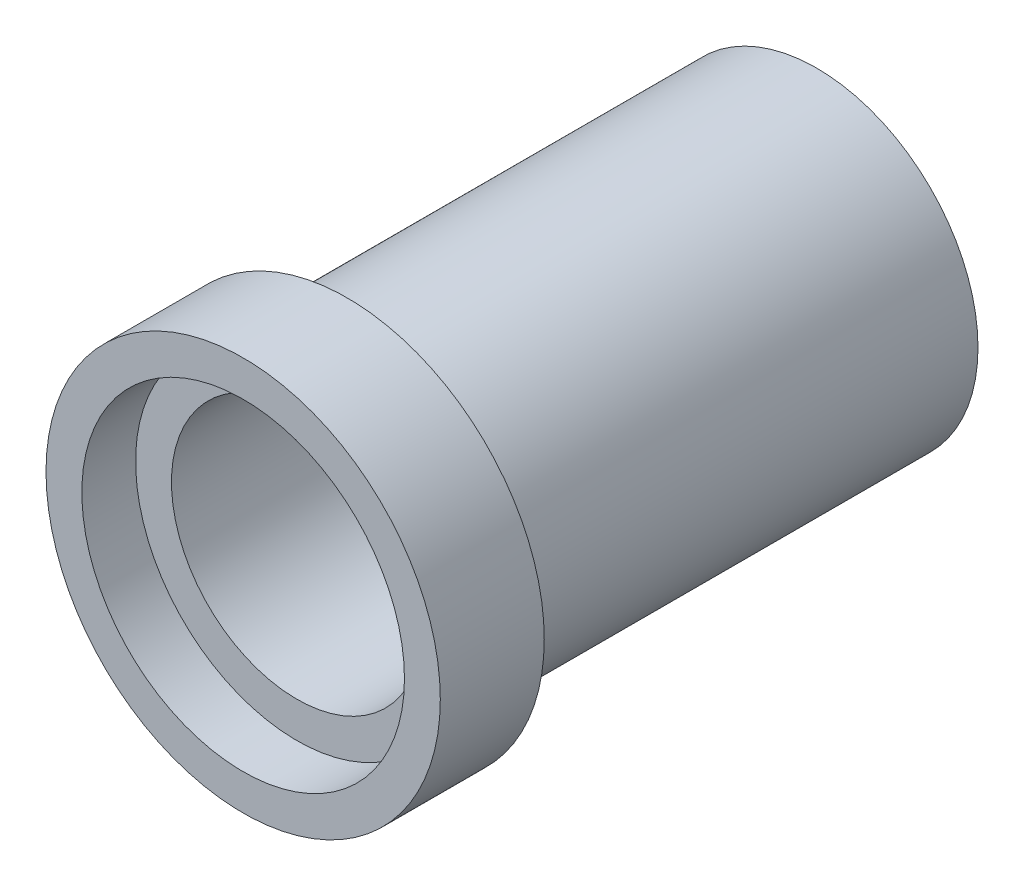
ISO-10303-21;
HEADER;
FILE_DESCRIPTION(('STEP AP214'),'2;1');
FILE_NAME('part.step','',(''),(''),'','','');
FILE_SCHEMA(('AUTOMOTIVE_DESIGN { 1 0 10303 214 1 1 1 1 }'));
ENDSEC;
DATA;
#1=APPLICATION_CONTEXT('core data for automotive mechanical design processes');
#2=APPLICATION_PROTOCOL_DEFINITION('international standard','automotive_design',2000,#1);
#3=PRODUCT_CONTEXT('',#1,'mechanical');
#4=PRODUCT('Part','Part','',(#3));
#5=PRODUCT_RELATED_PRODUCT_CATEGORY('part','',(#4));
#6=PRODUCT_DEFINITION_FORMATION('','',#4);
#7=PRODUCT_DEFINITION_CONTEXT('part definition',#1,'design');
#8=PRODUCT_DEFINITION('design','',#6,#7);
#9=PRODUCT_DEFINITION_SHAPE('','',#8);
#10=(LENGTH_UNIT() NAMED_UNIT(*) SI_UNIT(.MILLI.,.METRE.));
#11=(NAMED_UNIT(*) PLANE_ANGLE_UNIT() SI_UNIT($,.RADIAN.));
#12=(NAMED_UNIT(*) SI_UNIT($,.STERADIAN.) SOLID_ANGLE_UNIT());
#13=UNCERTAINTY_MEASURE_WITH_UNIT(LENGTH_MEASURE(1.E-05),#10,'distance_accuracy_value','');
#14=(GEOMETRIC_REPRESENTATION_CONTEXT(3) GLOBAL_UNCERTAINTY_ASSIGNED_CONTEXT((#13)) GLOBAL_UNIT_ASSIGNED_CONTEXT((#10,
#11,#12)) REPRESENTATION_CONTEXT('',''));
#15=CARTESIAN_POINT('',(0.,0.,0.));
#16=DIRECTION('',(0.,0.,1.));
#17=DIRECTION('',(1.,0.,0.));
#18=AXIS2_PLACEMENT_3D('',#15,#16,#17);
#19=CARTESIAN_POINT('',(0.,9.,16.));
#20=DIRECTION('',(0.,0.,-1.));
#21=DIRECTION('',(-1.,0.,0.));
#22=AXIS2_PLACEMENT_3D('',#19,#20,#21);
#23=PLANE('',#22);
#24=CARTESIAN_POINT('',(0.,0.,16.));
#25=DIRECTION('',(0.,0.,1.));
#26=DIRECTION('',(1.,0.,0.));
#27=AXIS2_PLACEMENT_3D('',#24,#25,#26);
#28=CIRCLE('',#27,9.);
#29=CARTESIAN_POINT('',(9.,0.,16.));
#30=VERTEX_POINT('',#29);
#31=EDGE_CURVE('E53',#30,#30,#28,.T.);
#32=ORIENTED_EDGE('',*,*,#31,.F.);
#33=EDGE_LOOP('',(#32));
#34=FACE_BOUND('',#33,.T.);
#35=CARTESIAN_POINT('',(0.,0.,16.));
#36=DIRECTION('',(0.,0.,1.));
#37=DIRECTION('',(1.,0.,0.));
#38=AXIS2_PLACEMENT_3D('',#35,#36,#37);
#39=CIRCLE('',#38,11.);
#40=CARTESIAN_POINT('',(11.,0.,16.));
#41=VERTEX_POINT('',#40);
#42=EDGE_CURVE('E10',#41,#41,#39,.T.);
#43=ORIENTED_EDGE('',*,*,#42,.T.);
#44=EDGE_LOOP('',(#43));
#45=FACE_BOUND('',#44,.T.);
#46=ADVANCED_FACE('F31',(#34,#45),#23,.F.);
#47=CARTESIAN_POINT('',(0.,0.,152.237580051673));
#48=DIRECTION('',(0.,0.,1.));
#49=DIRECTION('',(1.,0.,0.));
#50=AXIS2_PLACEMENT_3D('',#47,#48,#49);
#51=CYLINDRICAL_SURFACE('',#50,11.);
#52=ORIENTED_EDGE('',*,*,#42,.F.);
#53=EDGE_LOOP('',(#52));
#54=FACE_BOUND('',#53,.T.);
#55=CARTESIAN_POINT('',(0.,0.,10.2));
#56=DIRECTION('',(0.,0.,1.));
#57=DIRECTION('',(1.,0.,0.));
#58=AXIS2_PLACEMENT_3D('',#55,#56,#57);
#59=CIRCLE('',#58,11.);
#60=CARTESIAN_POINT('',(11.,0.,10.2));
#61=VERTEX_POINT('',#60);
#62=EDGE_CURVE('E37',#61,#61,#59,.T.);
#63=ORIENTED_EDGE('',*,*,#62,.T.);
#64=EDGE_LOOP('',(#63));
#65=FACE_BOUND('',#64,.T.);
#66=ADVANCED_FACE('F76',(#54,#65),#51,.T.);
#67=CARTESIAN_POINT('',(0.,11.,10.2));
#68=DIRECTION('',(0.,0.,1.));
#69=DIRECTION('',(1.,0.,0.));
#70=AXIS2_PLACEMENT_3D('',#67,#68,#69);
#71=PLANE('',#70);
#72=ORIENTED_EDGE('',*,*,#62,.F.);
#73=EDGE_LOOP('',(#72));
#74=FACE_BOUND('',#73,.T.);
#75=CARTESIAN_POINT('',(0.,0.,10.2));
#76=DIRECTION('',(0.,0.,1.));
#77=DIRECTION('',(1.,0.,0.));
#78=AXIS2_PLACEMENT_3D('',#75,#76,#77);
#79=CIRCLE('',#78,9.);
#80=CARTESIAN_POINT('',(9.,0.,10.2));
#81=VERTEX_POINT('',#80);
#82=EDGE_CURVE('E41',#81,#81,#79,.T.);
#83=ORIENTED_EDGE('',*,*,#82,.T.);
#84=EDGE_LOOP('',(#83));
#85=FACE_BOUND('',#84,.T.);
#86=ADVANCED_FACE('F81',(#74,#85),#71,.F.);
#87=CARTESIAN_POINT('',(0.,0.,152.237580051673));
#88=DIRECTION('',(0.,0.,1.));
#89=DIRECTION('',(1.,0.,0.));
#90=AXIS2_PLACEMENT_3D('',#87,#88,#89);
#91=CYLINDRICAL_SURFACE('',#90,9.);
#92=ORIENTED_EDGE('',*,*,#82,.F.);
#93=EDGE_LOOP('',(#92));
#94=FACE_BOUND('',#93,.T.);
#95=CARTESIAN_POINT('',(0.,0.,-16.));
#96=DIRECTION('',(0.,0.,1.));
#97=DIRECTION('',(1.,0.,0.));
#98=AXIS2_PLACEMENT_3D('',#95,#96,#97);
#99=CIRCLE('',#98,9.);
#100=CARTESIAN_POINT('',(9.,0.,-16.));
#101=VERTEX_POINT('',#100);
#102=EDGE_CURVE('E45',#101,#101,#99,.T.);
#103=ORIENTED_EDGE('',*,*,#102,.T.);
#104=EDGE_LOOP('',(#103));
#105=FACE_BOUND('',#104,.T.);
#106=ADVANCED_FACE('F88',(#94,#105),#91,.T.);
#107=CARTESIAN_POINT('',(0.,7.,-16.));
#108=DIRECTION('',(0.,0.,1.));
#109=DIRECTION('',(1.,0.,0.));
#110=AXIS2_PLACEMENT_3D('',#107,#108,#109);
#111=PLANE('',#110);
#112=ORIENTED_EDGE('',*,*,#102,.F.);
#113=EDGE_LOOP('',(#112));
#114=FACE_BOUND('',#113,.T.);
#115=CARTESIAN_POINT('',(0.,0.,-16.));
#116=DIRECTION('',(0.,0.,1.));
#117=DIRECTION('',(1.,0.,0.));
#118=AXIS2_PLACEMENT_3D('',#115,#116,#117);
#119=CIRCLE('',#118,7.);
#120=CARTESIAN_POINT('',(7.,0.,-16.));
#121=VERTEX_POINT('',#120);
#122=EDGE_CURVE('E50',#121,#121,#119,.T.);
#123=ORIENTED_EDGE('',*,*,#122,.T.);
#124=EDGE_LOOP('',(#123));
#125=FACE_BOUND('',#124,.T.);
#126=ADVANCED_FACE('F94',(#114,#125),#111,.F.);
#127=CARTESIAN_POINT('',(0.,0.,152.237580051673));
#128=DIRECTION('',(0.,0.,1.));
#129=DIRECTION('',(1.,0.,0.));
#130=AXIS2_PLACEMENT_3D('',#127,#128,#129);
#131=CYLINDRICAL_SURFACE('',#130,7.);
#132=ORIENTED_EDGE('',*,*,#122,.F.);
#133=EDGE_LOOP('',(#132));
#134=FACE_BOUND('',#133,.T.);
#135=CARTESIAN_POINT('',(0.,0.,13.));
#136=DIRECTION('',(0.,0.,1.));
#137=DIRECTION('',(1.,0.,0.));
#138=AXIS2_PLACEMENT_3D('',#135,#136,#137);
#139=CIRCLE('',#138,7.);
#140=CARTESIAN_POINT('',(7.,0.,13.));
#141=VERTEX_POINT('',#140);
#142=EDGE_CURVE('E59',#141,#141,#139,.T.);
#143=ORIENTED_EDGE('',*,*,#142,.T.);
#144=EDGE_LOOP('',(#143));
#145=FACE_BOUND('',#144,.T.);
#146=ADVANCED_FACE('F63',(#134,#145),#131,.F.);
#147=CARTESIAN_POINT('',(0.,0.,152.237580051673));
#148=DIRECTION('',(0.,0.,1.));
#149=DIRECTION('',(1.,0.,0.));
#150=AXIS2_PLACEMENT_3D('',#147,#148,#149);
#151=CYLINDRICAL_SURFACE('',#150,9.);
#152=CARTESIAN_POINT('',(0.,0.,13.));
#153=DIRECTION('',(0.,0.,1.));
#154=DIRECTION('',(1.,0.,0.));
#155=AXIS2_PLACEMENT_3D('',#152,#153,#154);
#156=CIRCLE('',#155,9.);
#157=CARTESIAN_POINT('',(9.,0.,13.));
#158=VERTEX_POINT('',#157);
#159=EDGE_CURVE('E56',#158,#158,#156,.T.);
#160=ORIENTED_EDGE('',*,*,#159,.F.);
#161=EDGE_LOOP('',(#160));
#162=FACE_BOUND('',#161,.T.);
#163=ORIENTED_EDGE('',*,*,#31,.T.);
#164=EDGE_LOOP('',(#163));
#165=FACE_BOUND('',#164,.T.);
#166=ADVANCED_FACE('F67',(#162,#165),#151,.F.);
#167=CARTESIAN_POINT('',(0.,0.,13.));
#168=DIRECTION('',(0.,0.,1.));
#169=DIRECTION('',(1.,0.,0.));
#170=AXIS2_PLACEMENT_3D('',#167,#168,#169);
#171=PLANE('',#170);
#172=ORIENTED_EDGE('',*,*,#159,.T.);
#173=EDGE_LOOP('',(#172));
#174=FACE_BOUND('',#173,.T.);
#175=ORIENTED_EDGE('',*,*,#142,.F.);
#176=EDGE_LOOP('',(#175));
#177=FACE_BOUND('',#176,.T.);
#178=ADVANCED_FACE('F65',(#174,#177),#171,.T.);
#179=CLOSED_SHELL('',(#46,#66,#86,#106,#126,#146,#166,#178));
#180=MANIFOLD_SOLID_BREP('B2',#179);
#181=ADVANCED_BREP_SHAPE_REPRESENTATION('',(#18,#180),#14);
#182=SHAPE_DEFINITION_REPRESENTATION(#9,#181);
ENDSEC;
END-ISO-10303-21;
